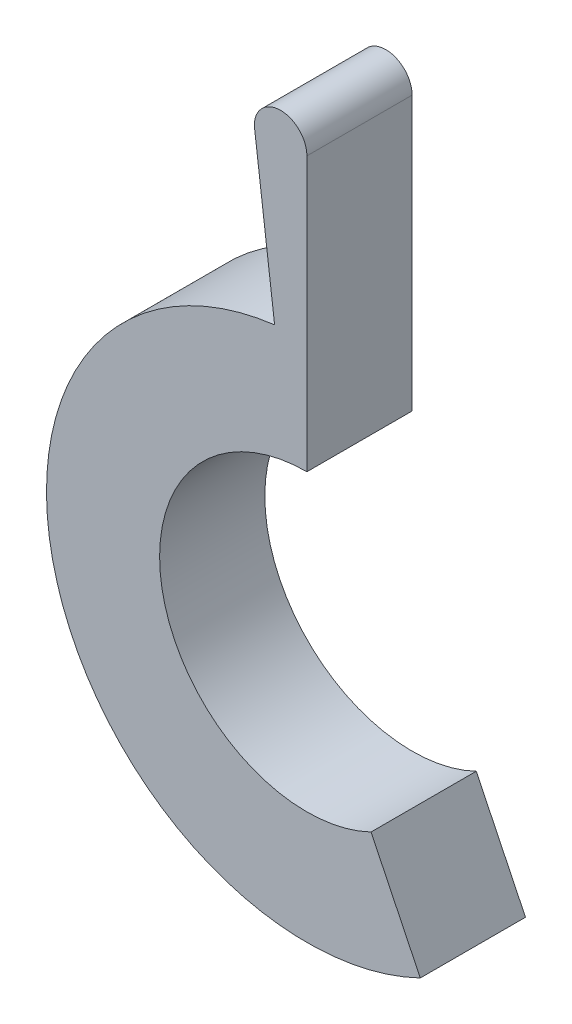
ISO-10303-21;
HEADER;
FILE_DESCRIPTION(('STEP AP214'),'2;1');
FILE_NAME('part.step','',(''),(''),'','','');
FILE_SCHEMA(('AUTOMOTIVE_DESIGN { 1 0 10303 214 1 1 1 1 }'));
ENDSEC;
DATA;
#1=APPLICATION_CONTEXT('core data for automotive mechanical design processes');
#2=APPLICATION_PROTOCOL_DEFINITION('international standard','automotive_design',2000,#1);
#3=PRODUCT_CONTEXT('',#1,'mechanical');
#4=PRODUCT('Part','Part','',(#3));
#5=PRODUCT_RELATED_PRODUCT_CATEGORY('part','',(#4));
#6=PRODUCT_DEFINITION_FORMATION('','',#4);
#7=PRODUCT_DEFINITION_CONTEXT('part definition',#1,'design');
#8=PRODUCT_DEFINITION('design','',#6,#7);
#9=PRODUCT_DEFINITION_SHAPE('','',#8);
#10=(LENGTH_UNIT() NAMED_UNIT(*) SI_UNIT(.MILLI.,.METRE.));
#11=(NAMED_UNIT(*) PLANE_ANGLE_UNIT() SI_UNIT($,.RADIAN.));
#12=(NAMED_UNIT(*) SI_UNIT($,.STERADIAN.) SOLID_ANGLE_UNIT());
#13=UNCERTAINTY_MEASURE_WITH_UNIT(LENGTH_MEASURE(1.E-05),#10,'distance_accuracy_value','');
#14=(GEOMETRIC_REPRESENTATION_CONTEXT(3) GLOBAL_UNCERTAINTY_ASSIGNED_CONTEXT((#13)) GLOBAL_UNIT_ASSIGNED_CONTEXT((#10,
#11,#12)) REPRESENTATION_CONTEXT('',''));
#15=CARTESIAN_POINT('',(0.,0.,0.));
#16=DIRECTION('',(0.,0.,1.));
#17=DIRECTION('',(1.,0.,0.));
#18=AXIS2_PLACEMENT_3D('',#15,#16,#17);
#19=CARTESIAN_POINT('',(0.,0.,10.));
#20=DIRECTION('',(0.,0.,-1.));
#21=DIRECTION('',(-1.,0.,0.));
#22=AXIS2_PLACEMENT_3D('',#19,#20,#21);
#23=CYLINDRICAL_SURFACE('',#22,14.);
#24=CARTESIAN_POINT('',(0.,0.,0.));
#25=DIRECTION('',(0.,0.,1.));
#26=DIRECTION('',(1.,0.,0.));
#27=AXIS2_PLACEMENT_3D('',#24,#25,#26);
#28=CIRCLE('',#27,14.);
#29=CARTESIAN_POINT('',(0.,14.,0.));
#30=VERTEX_POINT('',#29);
#31=CARTESIAN_POINT('',(6.09514029597005,-12.6035417550958,0.));
#32=VERTEX_POINT('',#31);
#33=EDGE_CURVE('E120',#30,#32,#28,.T.);
#34=ORIENTED_EDGE('',*,*,#33,.F.);
#35=DIRECTION('',(0.,0.,-1.));
#36=VECTOR('',#35,1.);
#37=CARTESIAN_POINT('',(0.,14.,10.));
#38=LINE('',#37,#36);
#39=CARTESIAN_POINT('',(0.,14.,10.));
#40=VERTEX_POINT('',#39);
#41=EDGE_CURVE('E11',#40,#30,#38,.T.);
#42=ORIENTED_EDGE('',*,*,#41,.F.);
#43=CARTESIAN_POINT('',(0.,0.,10.));
#44=DIRECTION('',(0.,0.,1.));
#45=DIRECTION('',(1.,0.,0.));
#46=AXIS2_PLACEMENT_3D('',#43,#44,#45);
#47=CIRCLE('',#46,14.);
#48=CARTESIAN_POINT('',(6.09514029597005,-12.6035417550958,10.));
#49=VERTEX_POINT('',#48);
#50=EDGE_CURVE('E133',#40,#49,#47,.T.);
#51=ORIENTED_EDGE('',*,*,#50,.T.);
#52=DIRECTION('',(0.,0.,-1.));
#53=VECTOR('',#52,1.);
#54=CARTESIAN_POINT('',(6.09514029597005,-12.6035417550958,10.));
#55=LINE('',#54,#53);
#56=EDGE_CURVE('E54',#49,#32,#55,.T.);
#57=ORIENTED_EDGE('',*,*,#56,.T.);
#58=EDGE_LOOP('',(#34,#42,#51,#57));
#59=FACE_BOUND('',#58,.T.);
#60=ADVANCED_FACE('F38',(#59),#23,.F.);
#61=CARTESIAN_POINT('',(0.,0.,10.));
#62=DIRECTION('',(1.,0.,0.));
#63=DIRECTION('',(0.,0.,-1.));
#64=AXIS2_PLACEMENT_3D('',#61,#62,#63);
#65=PLANE('',#64);
#66=DIRECTION('',(0.,-1.,0.));
#67=VECTOR('',#66,1.);
#68=CARTESIAN_POINT('',(0.,0.,0.));
#69=LINE('',#68,#67);
#70=CARTESIAN_POINT('',(0.,40.,0.));
#71=VERTEX_POINT('',#70);
#72=EDGE_CURVE('E122',#71,#30,#69,.T.);
#73=ORIENTED_EDGE('',*,*,#72,.F.);
#74=DIRECTION('',(0.,0.,-1.));
#75=VECTOR('',#74,1.);
#76=CARTESIAN_POINT('',(0.,40.,10.));
#77=LINE('',#76,#75);
#78=CARTESIAN_POINT('',(0.,40.,10.));
#79=VERTEX_POINT('',#78);
#80=EDGE_CURVE('E46',#79,#71,#77,.T.);
#81=ORIENTED_EDGE('',*,*,#80,.F.);
#82=DIRECTION('',(0.,-1.,0.));
#83=VECTOR('',#82,1.);
#84=CARTESIAN_POINT('',(0.,0.,10.));
#85=LINE('',#84,#83);
#86=EDGE_CURVE('E145',#79,#40,#85,.T.);
#87=ORIENTED_EDGE('',*,*,#86,.T.);
#88=ORIENTED_EDGE('',*,*,#41,.T.);
#89=EDGE_LOOP('',(#73,#81,#87,#88));
#90=FACE_BOUND('',#89,.T.);
#91=ADVANCED_FACE('F144',(#90),#65,.T.);
#92=CARTESIAN_POINT('',(-2.5,40.,10.));
#93=DIRECTION('',(0.,0.,-1.));
#94=DIRECTION('',(-1.,0.,0.));
#95=AXIS2_PLACEMENT_3D('',#92,#93,#94);
#96=CYLINDRICAL_SURFACE('',#95,2.5);
#97=CARTESIAN_POINT('',(-2.5,40.,0.));
#98=DIRECTION('',(0.,0.,1.));
#99=DIRECTION('',(1.,0.,0.));
#100=AXIS2_PLACEMENT_3D('',#97,#98,#99);
#101=CIRCLE('',#100,2.5);
#102=CARTESIAN_POINT('',(-5.,40.,0.));
#103=VERTEX_POINT('',#102);
#104=EDGE_CURVE('E125',#71,#103,#101,.T.);
#105=ORIENTED_EDGE('',*,*,#104,.T.);
#106=DIRECTION('',(0.,0.,-1.));
#107=VECTOR('',#106,1.);
#108=CARTESIAN_POINT('',(-5.,40.,10.));
#109=LINE('',#108,#107);
#110=CARTESIAN_POINT('',(-5.,40.,10.));
#111=VERTEX_POINT('',#110);
#112=EDGE_CURVE('E112',#111,#103,#109,.T.);
#113=ORIENTED_EDGE('',*,*,#112,.F.);
#114=CARTESIAN_POINT('',(-2.5,40.,10.));
#115=DIRECTION('',(0.,0.,1.));
#116=DIRECTION('',(1.,0.,0.));
#117=AXIS2_PLACEMENT_3D('',#114,#115,#116);
#118=CIRCLE('',#117,2.5);
#119=EDGE_CURVE('E100',#79,#111,#118,.T.);
#120=ORIENTED_EDGE('',*,*,#119,.F.);
#121=ORIENTED_EDGE('',*,*,#80,.T.);
#122=EDGE_LOOP('',(#105,#113,#120,#121));
#123=FACE_BOUND('',#122,.T.);
#124=ADVANCED_FACE('F138',(#123),#96,.T.);
#125=CARTESIAN_POINT('',(0.,0.,10.));
#126=DIRECTION('',(0.992277876713667,0.124034734589211,0.));
#127=DIRECTION('',(-0.124034734589211,0.992277876713667,0.));
#128=AXIS2_PLACEMENT_3D('',#125,#126,#127);
#129=PLANE('',#128);
#130=DIRECTION('',(0.124034734589211,-0.992277876713667,0.));
#131=VECTOR('',#130,1.);
#132=CARTESIAN_POINT('',(0.,0.,0.));
#133=LINE('',#132,#131);
#134=CARTESIAN_POINT('',(-3.06985968108287,24.5588774486633,0.));
#135=VERTEX_POINT('',#134);
#136=EDGE_CURVE('E109',#103,#135,#133,.T.);
#137=ORIENTED_EDGE('',*,*,#136,.T.);
#138=DIRECTION('',(0.,0.,-1.));
#139=VECTOR('',#138,1.);
#140=CARTESIAN_POINT('',(-3.06985968108287,24.5588774486633,10.));
#141=LINE('',#140,#139);
#142=CARTESIAN_POINT('',(-3.06985968108287,24.5588774486633,10.));
#143=VERTEX_POINT('',#142);
#144=EDGE_CURVE('E106',#143,#135,#141,.T.);
#145=ORIENTED_EDGE('',*,*,#144,.F.);
#146=DIRECTION('',(0.124034734589211,-0.992277876713667,0.));
#147=VECTOR('',#146,1.);
#148=CARTESIAN_POINT('',(0.,0.,10.));
#149=LINE('',#148,#147);
#150=EDGE_CURVE('E92',#111,#143,#149,.T.);
#151=ORIENTED_EDGE('',*,*,#150,.F.);
#152=ORIENTED_EDGE('',*,*,#112,.T.);
#153=EDGE_LOOP('',(#137,#145,#151,#152));
#154=FACE_BOUND('',#153,.T.);
#155=ADVANCED_FACE('F107',(#154),#129,.F.);
#156=CARTESIAN_POINT('',(0.,0.,10.));
#157=DIRECTION('',(0.,0.,-1.));
#158=DIRECTION('',(-1.,0.,0.));
#159=AXIS2_PLACEMENT_3D('',#156,#157,#158);
#160=CYLINDRICAL_SURFACE('',#159,24.75);
#161=CARTESIAN_POINT('',(0.,0.,0.));
#162=DIRECTION('',(0.,0.,1.));
#163=DIRECTION('',(1.,0.,0.));
#164=AXIS2_PLACEMENT_3D('',#161,#162,#163);
#165=CIRCLE('',#164,24.75);
#166=CARTESIAN_POINT('',(10.7753373089471,-22.2812613170443,0.));
#167=VERTEX_POINT('',#166);
#168=EDGE_CURVE('E128',#135,#167,#165,.T.);
#169=ORIENTED_EDGE('',*,*,#168,.T.);
#170=DIRECTION('',(0.,0.,-1.));
#171=VECTOR('',#170,1.);
#172=CARTESIAN_POINT('',(10.7753373089471,-22.2812613170443,10.));
#173=LINE('',#172,#171);
#174=CARTESIAN_POINT('',(10.7753373089471,-22.2812613170443,10.));
#175=VERTEX_POINT('',#174);
#176=EDGE_CURVE('E74',#175,#167,#173,.T.);
#177=ORIENTED_EDGE('',*,*,#176,.F.);
#178=CARTESIAN_POINT('',(0.,0.,10.));
#179=DIRECTION('',(0.,0.,1.));
#180=DIRECTION('',(1.,0.,0.));
#181=AXIS2_PLACEMENT_3D('',#178,#179,#180);
#182=CIRCLE('',#181,24.75);
#183=EDGE_CURVE('E97',#143,#175,#182,.T.);
#184=ORIENTED_EDGE('',*,*,#183,.F.);
#185=ORIENTED_EDGE('',*,*,#144,.T.);
#186=EDGE_LOOP('',(#169,#177,#184,#185));
#187=FACE_BOUND('',#186,.T.);
#188=ADVANCED_FACE('F114',(#187),#160,.T.);
#189=CARTESIAN_POINT('',(0.,0.,10.));
#190=DIRECTION('',(0.90025298250684,0.43536716399786,0.));
#191=DIRECTION('',(-0.43536716399786,0.90025298250684,0.));
#192=AXIS2_PLACEMENT_3D('',#189,#190,#191);
#193=PLANE('',#192);
#194=DIRECTION('',(0.43536716399786,-0.90025298250684,0.));
#195=VECTOR('',#194,1.);
#196=CARTESIAN_POINT('',(0.,0.,0.));
#197=LINE('',#196,#195);
#198=EDGE_CURVE('E130',#32,#167,#197,.T.);
#199=ORIENTED_EDGE('',*,*,#198,.F.);
#200=ORIENTED_EDGE('',*,*,#56,.F.);
#201=DIRECTION('',(0.43536716399786,-0.90025298250684,0.));
#202=VECTOR('',#201,1.);
#203=CARTESIAN_POINT('',(0.,0.,10.));
#204=LINE('',#203,#202);
#205=EDGE_CURVE('E115',#49,#175,#204,.T.);
#206=ORIENTED_EDGE('',*,*,#205,.T.);
#207=ORIENTED_EDGE('',*,*,#176,.T.);
#208=EDGE_LOOP('',(#199,#200,#206,#207));
#209=FACE_BOUND('',#208,.T.);
#210=ADVANCED_FACE('F146',(#209),#193,.T.);
#211=CARTESIAN_POINT('',(0.,0.,10.));
#212=DIRECTION('',(0.,0.,1.));
#213=DIRECTION('',(1.,0.,0.));
#214=AXIS2_PLACEMENT_3D('',#211,#212,#213);
#215=PLANE('',#214);
#216=ORIENTED_EDGE('',*,*,#50,.F.);
#217=ORIENTED_EDGE('',*,*,#86,.F.);
#218=ORIENTED_EDGE('',*,*,#119,.T.);
#219=ORIENTED_EDGE('',*,*,#150,.T.);
#220=ORIENTED_EDGE('',*,*,#183,.T.);
#221=ORIENTED_EDGE('',*,*,#205,.F.);
#222=EDGE_LOOP('',(#216,#217,#218,#219,#220,#221));
#223=FACE_BOUND('',#222,.T.);
#224=ADVANCED_FACE('F94',(#223),#215,.T.);
#225=CARTESIAN_POINT('',(0.,0.,0.));
#226=DIRECTION('',(0.,0.,1.));
#227=DIRECTION('',(1.,0.,0.));
#228=AXIS2_PLACEMENT_3D('',#225,#226,#227);
#229=PLANE('',#228);
#230=ORIENTED_EDGE('',*,*,#33,.T.);
#231=ORIENTED_EDGE('',*,*,#198,.T.);
#232=ORIENTED_EDGE('',*,*,#168,.F.);
#233=ORIENTED_EDGE('',*,*,#136,.F.);
#234=ORIENTED_EDGE('',*,*,#104,.F.);
#235=ORIENTED_EDGE('',*,*,#72,.T.);
#236=EDGE_LOOP('',(#230,#231,#232,#233,#234,#235));
#237=FACE_BOUND('',#236,.T.);
#238=ADVANCED_FACE('F143',(#237),#229,.F.);
#239=CLOSED_SHELL('',(#60,#91,#124,#155,#188,#210,#224,#238));
#240=MANIFOLD_SOLID_BREP('B2',#239);
#241=ADVANCED_BREP_SHAPE_REPRESENTATION('',(#18,#240),#14);
#242=SHAPE_DEFINITION_REPRESENTATION(#9,#241);
ENDSEC;
END-ISO-10303-21;
